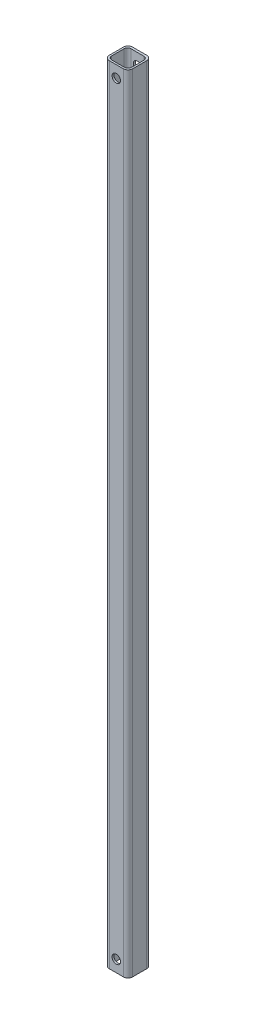
ISO-10303-21;
HEADER;
FILE_DESCRIPTION(('STEP AP214'),'2;1');
FILE_NAME('part.step','',(''),(''),'','','');
FILE_SCHEMA(('AUTOMOTIVE_DESIGN { 1 0 10303 214 1 1 1 1 }'));
ENDSEC;
DATA;
#1=APPLICATION_CONTEXT('core data for automotive mechanical design processes');
#2=APPLICATION_PROTOCOL_DEFINITION('international standard','automotive_design',2000,#1);
#3=PRODUCT_CONTEXT('',#1,'mechanical');
#4=PRODUCT('Part','Part','',(#3));
#5=PRODUCT_RELATED_PRODUCT_CATEGORY('part','',(#4));
#6=PRODUCT_DEFINITION_FORMATION('','',#4);
#7=PRODUCT_DEFINITION_CONTEXT('part definition',#1,'design');
#8=PRODUCT_DEFINITION('design','',#6,#7);
#9=PRODUCT_DEFINITION_SHAPE('','',#8);
#10=(LENGTH_UNIT() NAMED_UNIT(*) SI_UNIT(.MILLI.,.METRE.));
#11=(NAMED_UNIT(*) PLANE_ANGLE_UNIT() SI_UNIT($,.RADIAN.));
#12=(NAMED_UNIT(*) SI_UNIT($,.STERADIAN.) SOLID_ANGLE_UNIT());
#13=UNCERTAINTY_MEASURE_WITH_UNIT(LENGTH_MEASURE(1.E-05),#10,'distance_accuracy_value','');
#14=(GEOMETRIC_REPRESENTATION_CONTEXT(3) GLOBAL_UNCERTAINTY_ASSIGNED_CONTEXT((#13)) GLOBAL_UNIT_ASSIGNED_CONTEXT((#10,
#11,#12)) REPRESENTATION_CONTEXT('',''));
#15=CARTESIAN_POINT('',(0.,0.,0.));
#16=DIRECTION('',(0.,0.,1.));
#17=DIRECTION('',(1.,0.,0.));
#18=AXIS2_PLACEMENT_3D('',#15,#16,#17);
#19=CARTESIAN_POINT('',(9.525,533.4,-15.875));
#20=DIRECTION('',(0.,0.,1.));
#21=DIRECTION('',(1.,0.,0.));
#22=AXIS2_PLACEMENT_3D('',#19,#20,#21);
#23=PLANE('',#22);
#24=DIRECTION('',(-1.,0.,0.));
#25=VECTOR('',#24,1.);
#26=CARTESIAN_POINT('',(9.525,-533.4,-15.875));
#27=LINE('',#26,#25);
#28=CARTESIAN_POINT('',(9.525,-533.4,-15.875));
#29=VERTEX_POINT('',#28);
#30=CARTESIAN_POINT('',(-9.525,-533.4,-15.875));
#31=VERTEX_POINT('',#30);
#32=EDGE_CURVE('E247',#29,#31,#27,.T.);
#33=ORIENTED_EDGE('',*,*,#32,.T.);
#34=DIRECTION('',(0.,-1.,0.));
#35=VECTOR('',#34,1.);
#36=CARTESIAN_POINT('',(-9.525,533.4,-15.875));
#37=LINE('',#36,#35);
#38=CARTESIAN_POINT('',(-9.525,533.4,-15.875));
#39=VERTEX_POINT('',#38);
#40=EDGE_CURVE('E45',#39,#31,#37,.T.);
#41=ORIENTED_EDGE('',*,*,#40,.F.);
#42=DIRECTION('',(-1.,0.,0.));
#43=VECTOR('',#42,1.);
#44=CARTESIAN_POINT('',(9.525,533.4,-15.875));
#45=LINE('',#44,#43);
#46=CARTESIAN_POINT('',(9.525,533.4,-15.875));
#47=VERTEX_POINT('',#46);
#48=EDGE_CURVE('E229',#47,#39,#45,.T.);
#49=ORIENTED_EDGE('',*,*,#48,.F.);
#50=DIRECTION('',(0.,-1.,0.));
#51=VECTOR('',#50,1.);
#52=CARTESIAN_POINT('',(9.525,533.4,-15.875));
#53=LINE('',#52,#51);
#54=EDGE_CURVE('E11',#47,#29,#53,.T.);
#55=ORIENTED_EDGE('',*,*,#54,.T.);
#56=EDGE_LOOP('',(#33,#41,#49,#55));
#57=FACE_BOUND('',#56,.T.);
#58=CARTESIAN_POINT('',(0.,517.525,-15.875));
#59=DIRECTION('',(0.,0.,1.));
#60=DIRECTION('',(1.,0.,0.));
#61=AXIS2_PLACEMENT_3D('',#58,#59,#60);
#62=CIRCLE('',#61,5.71499999999998);
#63=CARTESIAN_POINT('',(5.71499999999998,517.525,-15.875));
#64=VERTEX_POINT('',#63);
#65=EDGE_CURVE('E286',#64,#64,#62,.T.);
#66=ORIENTED_EDGE('',*,*,#65,.T.);
#67=EDGE_LOOP('',(#66));
#68=FACE_BOUND('',#67,.T.);
#69=CARTESIAN_POINT('',(0.,-517.525,-15.875));
#70=DIRECTION('',(0.,0.,-1.));
#71=DIRECTION('',(1.,0.,0.));
#72=AXIS2_PLACEMENT_3D('',#69,#70,#71);
#73=CIRCLE('',#72,5.71499999999998);
#74=CARTESIAN_POINT('',(5.71499999999998,-517.525,-15.875));
#75=VERTEX_POINT('',#74);
#76=EDGE_CURVE('E304',#75,#75,#73,.T.);
#77=ORIENTED_EDGE('',*,*,#76,.F.);
#78=EDGE_LOOP('',(#77));
#79=FACE_BOUND('',#78,.T.);
#80=ADVANCED_FACE('F36',(#57,#68,#79),#23,.F.);
#81=CARTESIAN_POINT('',(-9.525,533.4,15.875));
#82=DIRECTION('',(0.,0.,-1.));
#83=DIRECTION('',(-1.,0.,0.));
#84=AXIS2_PLACEMENT_3D('',#81,#82,#83);
#85=PLANE('',#84);
#86=DIRECTION('',(1.,0.,0.));
#87=VECTOR('',#86,1.);
#88=CARTESIAN_POINT('',(-9.525,-533.4,15.875));
#89=LINE('',#88,#87);
#90=CARTESIAN_POINT('',(-9.525,-533.4,15.875));
#91=VERTEX_POINT('',#90);
#92=CARTESIAN_POINT('',(9.525,-533.4,15.875));
#93=VERTEX_POINT('',#92);
#94=EDGE_CURVE('E255',#91,#93,#89,.T.);
#95=ORIENTED_EDGE('',*,*,#94,.T.);
#96=DIRECTION('',(0.,-1.,0.));
#97=VECTOR('',#96,1.);
#98=CARTESIAN_POINT('',(9.525,533.4,15.875));
#99=LINE('',#98,#97);
#100=CARTESIAN_POINT('',(9.525,533.4,15.875));
#101=VERTEX_POINT('',#100);
#102=EDGE_CURVE('E267',#101,#93,#99,.T.);
#103=ORIENTED_EDGE('',*,*,#102,.F.);
#104=DIRECTION('',(1.,0.,0.));
#105=VECTOR('',#104,1.);
#106=CARTESIAN_POINT('',(-9.525,533.4,15.875));
#107=LINE('',#106,#105);
#108=CARTESIAN_POINT('',(-9.525,533.4,15.875));
#109=VERTEX_POINT('',#108);
#110=EDGE_CURVE('E238',#109,#101,#107,.T.);
#111=ORIENTED_EDGE('',*,*,#110,.F.);
#112=DIRECTION('',(0.,-1.,0.));
#113=VECTOR('',#112,1.);
#114=CARTESIAN_POINT('',(-9.525,533.4,15.875));
#115=LINE('',#114,#113);
#116=EDGE_CURVE('E271',#109,#91,#115,.T.);
#117=ORIENTED_EDGE('',*,*,#116,.T.);
#118=EDGE_LOOP('',(#95,#103,#111,#117));
#119=FACE_BOUND('',#118,.T.);
#120=CARTESIAN_POINT('',(0.,517.525,15.875));
#121=DIRECTION('',(0.,0.,1.));
#122=DIRECTION('',(1.,0.,0.));
#123=AXIS2_PLACEMENT_3D('',#120,#121,#122);
#124=CIRCLE('',#123,5.71499999999998);
#125=CARTESIAN_POINT('',(5.71499999999998,517.525,15.875));
#126=VERTEX_POINT('',#125);
#127=EDGE_CURVE('E291',#126,#126,#124,.T.);
#128=ORIENTED_EDGE('',*,*,#127,.F.);
#129=EDGE_LOOP('',(#128));
#130=FACE_BOUND('',#129,.T.);
#131=CARTESIAN_POINT('',(0.,-517.525,15.875));
#132=DIRECTION('',(0.,0.,-1.));
#133=DIRECTION('',(1.,0.,0.));
#134=AXIS2_PLACEMENT_3D('',#131,#132,#133);
#135=CIRCLE('',#134,5.71499999999998);
#136=CARTESIAN_POINT('',(5.71499999999998,-517.525,15.875));
#137=VERTEX_POINT('',#136);
#138=EDGE_CURVE('E301',#137,#137,#135,.T.);
#139=ORIENTED_EDGE('',*,*,#138,.T.);
#140=EDGE_LOOP('',(#139));
#141=FACE_BOUND('',#140,.T.);
#142=ADVANCED_FACE('F327',(#119,#130,#141),#85,.F.);
#143=CARTESIAN_POINT('',(-8.6995,533.4,13.462));
#144=DIRECTION('',(0.,0.,-1.));
#145=DIRECTION('',(-1.,0.,0.));
#146=AXIS2_PLACEMENT_3D('',#143,#144,#145);
#147=PLANE('',#146);
#148=DIRECTION('',(1.,0.,0.));
#149=VECTOR('',#148,1.);
#150=CARTESIAN_POINT('',(-8.6995,-533.4,13.462));
#151=LINE('',#150,#149);
#152=CARTESIAN_POINT('',(-8.6995,-533.4,13.462));
#153=VERTEX_POINT('',#152);
#154=CARTESIAN_POINT('',(8.69949999999999,-533.4,13.462));
#155=VERTEX_POINT('',#154);
#156=EDGE_CURVE('E195',#153,#155,#151,.T.);
#157=ORIENTED_EDGE('',*,*,#156,.F.);
#158=DIRECTION('',(0.,-1.,0.));
#159=VECTOR('',#158,1.);
#160=CARTESIAN_POINT('',(-8.6995,533.4,13.462));
#161=LINE('',#160,#159);
#162=CARTESIAN_POINT('',(-8.6995,533.4,13.462));
#163=VERTEX_POINT('',#162);
#164=EDGE_CURVE('E221',#163,#153,#161,.T.);
#165=ORIENTED_EDGE('',*,*,#164,.F.);
#166=DIRECTION('',(1.,0.,0.));
#167=VECTOR('',#166,1.);
#168=CARTESIAN_POINT('',(-8.6995,533.4,13.462));
#169=LINE('',#168,#167);
#170=CARTESIAN_POINT('',(8.69949999999999,533.4,13.462));
#171=VERTEX_POINT('',#170);
#172=EDGE_CURVE('E176',#163,#171,#169,.T.);
#173=ORIENTED_EDGE('',*,*,#172,.T.);
#174=DIRECTION('',(0.,-1.,0.));
#175=VECTOR('',#174,1.);
#176=CARTESIAN_POINT('',(8.69949999999999,533.4,13.462));
#177=LINE('',#176,#175);
#178=EDGE_CURVE('E218',#171,#155,#177,.T.);
#179=ORIENTED_EDGE('',*,*,#178,.T.);
#180=EDGE_LOOP('',(#157,#165,#173,#179));
#181=FACE_BOUND('',#180,.T.);
#182=CARTESIAN_POINT('',(0.,517.525,13.462));
#183=DIRECTION('',(0.,0.,-1.));
#184=DIRECTION('',(-1.,0.,0.));
#185=AXIS2_PLACEMENT_3D('',#182,#183,#184);
#186=CIRCLE('',#185,5.71499999999998);
#187=CARTESIAN_POINT('',(-5.71499999999999,517.525,13.462));
#188=VERTEX_POINT('',#187);
#189=EDGE_CURVE('E190',#188,#188,#186,.T.);
#190=ORIENTED_EDGE('',*,*,#189,.F.);
#191=EDGE_LOOP('',(#190));
#192=FACE_BOUND('',#191,.T.);
#193=CARTESIAN_POINT('',(0.,-517.525,13.462));
#194=DIRECTION('',(0.,0.,-1.));
#195=DIRECTION('',(-1.,0.,0.));
#196=AXIS2_PLACEMENT_3D('',#193,#194,#195);
#197=CIRCLE('',#196,5.71499999999998);
#198=CARTESIAN_POINT('',(-5.71499999999999,-517.525,13.462));
#199=VERTEX_POINT('',#198);
#200=EDGE_CURVE('E296',#199,#199,#197,.F.);
#201=ORIENTED_EDGE('',*,*,#200,.T.);
#202=EDGE_LOOP('',(#201));
#203=FACE_BOUND('',#202,.T.);
#204=ADVANCED_FACE('F332',(#181,#192,#203),#147,.T.);
#205=CARTESIAN_POINT('',(8.6995,533.4,-12.827));
#206=DIRECTION('',(0.,0.,1.));
#207=DIRECTION('',(1.,0.,0.));
#208=AXIS2_PLACEMENT_3D('',#205,#206,#207);
#209=PLANE('',#208);
#210=DIRECTION('',(-1.,0.,0.));
#211=VECTOR('',#210,1.);
#212=CARTESIAN_POINT('',(8.6995,-533.4,-12.827));
#213=LINE('',#212,#211);
#214=CARTESIAN_POINT('',(8.6995,-533.4,-12.827));
#215=VERTEX_POINT('',#214);
#216=CARTESIAN_POINT('',(-8.69950000000001,-533.4,-12.827));
#217=VERTEX_POINT('',#216);
#218=EDGE_CURVE('E160',#215,#217,#213,.T.);
#219=ORIENTED_EDGE('',*,*,#218,.F.);
#220=DIRECTION('',(0.,-1.,0.));
#221=VECTOR('',#220,1.);
#222=CARTESIAN_POINT('',(8.6995,533.4,-12.827));
#223=LINE('',#222,#221);
#224=CARTESIAN_POINT('',(8.6995,533.4,-12.827));
#225=VERTEX_POINT('',#224);
#226=EDGE_CURVE('E53',#225,#215,#223,.T.);
#227=ORIENTED_EDGE('',*,*,#226,.F.);
#228=DIRECTION('',(-1.,0.,0.));
#229=VECTOR('',#228,1.);
#230=CARTESIAN_POINT('',(8.6995,533.4,-12.827));
#231=LINE('',#230,#229);
#232=CARTESIAN_POINT('',(-8.69950000000001,533.4,-12.827));
#233=VERTEX_POINT('',#232);
#234=EDGE_CURVE('E187',#225,#233,#231,.T.);
#235=ORIENTED_EDGE('',*,*,#234,.T.);
#236=DIRECTION('',(0.,-1.,0.));
#237=VECTOR('',#236,1.);
#238=CARTESIAN_POINT('',(-8.69950000000001,533.4,-12.827));
#239=LINE('',#238,#237);
#240=EDGE_CURVE('E155',#233,#217,#239,.T.);
#241=ORIENTED_EDGE('',*,*,#240,.T.);
#242=EDGE_LOOP('',(#219,#227,#235,#241));
#243=FACE_BOUND('',#242,.T.);
#244=CARTESIAN_POINT('',(0.,517.525,-12.827));
#245=DIRECTION('',(0.,0.,1.));
#246=DIRECTION('',(1.,0.,0.));
#247=AXIS2_PLACEMENT_3D('',#244,#245,#246);
#248=CIRCLE('',#247,5.71499999999998);
#249=CARTESIAN_POINT('',(5.71499999999998,517.525,-12.827));
#250=VERTEX_POINT('',#249);
#251=EDGE_CURVE('E284',#250,#250,#248,.T.);
#252=ORIENTED_EDGE('',*,*,#251,.F.);
#253=EDGE_LOOP('',(#252));
#254=FACE_BOUND('',#253,.T.);
#255=CARTESIAN_POINT('',(0.,-517.525,-12.827));
#256=DIRECTION('',(0.,0.,1.));
#257=DIRECTION('',(1.,0.,0.));
#258=AXIS2_PLACEMENT_3D('',#255,#256,#257);
#259=CIRCLE('',#258,5.71499999999998);
#260=CARTESIAN_POINT('',(5.71499999999998,-517.525,-12.827));
#261=VERTEX_POINT('',#260);
#262=EDGE_CURVE('E40',#261,#261,#259,.F.);
#263=ORIENTED_EDGE('',*,*,#262,.T.);
#264=EDGE_LOOP('',(#263));
#265=FACE_BOUND('',#264,.T.);
#266=ADVANCED_FACE('F311',(#243,#254,#265),#209,.T.);
#267=CARTESIAN_POINT('',(9.525,533.4,-9.52499999999998));
#268=DIRECTION('',(0.,1.,0.));
#269=DIRECTION('',(0.,0.,1.));
#270=AXIS2_PLACEMENT_3D('',#267,#268,#269);
#271=PLANE('',#270);
#272=CARTESIAN_POINT('',(9.525,533.4,-9.52499999999998));
#273=DIRECTION('',(0.,1.,0.));
#274=DIRECTION('',(0.,0.,1.));
#275=AXIS2_PLACEMENT_3D('',#272,#273,#274);
#276=CIRCLE('',#275,6.35);
#277=CARTESIAN_POINT('',(15.875,533.4,-9.52499999999998));
#278=VERTEX_POINT('',#277);
#279=EDGE_CURVE('E226',#278,#47,#276,.T.);
#280=ORIENTED_EDGE('',*,*,#279,.T.);
#281=ORIENTED_EDGE('',*,*,#48,.T.);
#282=CARTESIAN_POINT('',(-9.525,533.4,-9.52499999999998));
#283=DIRECTION('',(0.,1.,0.));
#284=DIRECTION('',(0.,0.,1.));
#285=AXIS2_PLACEMENT_3D('',#282,#283,#284);
#286=CIRCLE('',#285,6.35);
#287=CARTESIAN_POINT('',(-15.875,533.4,-9.52499999999998));
#288=VERTEX_POINT('',#287);
#289=EDGE_CURVE('E232',#39,#288,#286,.T.);
#290=ORIENTED_EDGE('',*,*,#289,.T.);
#291=DIRECTION('',(0.,0.,1.));
#292=VECTOR('',#291,1.);
#293=CARTESIAN_POINT('',(-15.875,533.4,9.52500000000002));
#294=LINE('',#293,#292);
#295=CARTESIAN_POINT('',(-15.875,533.4,9.52500000000002));
#296=VERTEX_POINT('',#295);
#297=EDGE_CURVE('E234',#288,#296,#294,.T.);
#298=ORIENTED_EDGE('',*,*,#297,.T.);
#299=CARTESIAN_POINT('',(-9.525,533.4,9.52500000000002));
#300=DIRECTION('',(0.,1.,0.));
#301=DIRECTION('',(0.,0.,1.));
#302=AXIS2_PLACEMENT_3D('',#299,#300,#301);
#303=CIRCLE('',#302,6.35);
#304=EDGE_CURVE('E236',#296,#109,#303,.T.);
#305=ORIENTED_EDGE('',*,*,#304,.T.);
#306=ORIENTED_EDGE('',*,*,#110,.T.);
#307=CARTESIAN_POINT('',(9.525,533.4,9.52500000000002));
#308=DIRECTION('',(0.,1.,0.));
#309=DIRECTION('',(0.,0.,1.));
#310=AXIS2_PLACEMENT_3D('',#307,#308,#309);
#311=CIRCLE('',#310,6.35);
#312=CARTESIAN_POINT('',(15.875,533.4,9.52500000000002));
#313=VERTEX_POINT('',#312);
#314=EDGE_CURVE('E240',#101,#313,#311,.T.);
#315=ORIENTED_EDGE('',*,*,#314,.T.);
#316=DIRECTION('',(0.,0.,-1.));
#317=VECTOR('',#316,1.);
#318=CARTESIAN_POINT('',(15.875,533.4,-9.52499999999998));
#319=LINE('',#318,#317);
#320=EDGE_CURVE('E242',#313,#278,#319,.T.);
#321=ORIENTED_EDGE('',*,*,#320,.T.);
#322=EDGE_LOOP('',(#280,#281,#290,#298,#305,#306,#315,#321));
#323=FACE_BOUND('',#322,.T.);
#324=DIRECTION('',(0.,0.,1.));
#325=VECTOR('',#324,1.);
#326=CARTESIAN_POINT('',(-13.462,533.4,8.69950000000002));
#327=LINE('',#326,#325);
#328=CARTESIAN_POINT('',(-13.462,533.4,-8.06449999999998));
#329=VERTEX_POINT('',#328);
#330=CARTESIAN_POINT('',(-13.462,533.4,8.69950000000002));
#331=VERTEX_POINT('',#330);
#332=EDGE_CURVE('E159',#329,#331,#327,.T.);
#333=ORIENTED_EDGE('',*,*,#332,.F.);
#334=CARTESIAN_POINT('',(-8.69950000000001,533.4,-8.06449999999998));
#335=DIRECTION('',(0.,1.,0.));
#336=DIRECTION('',(0.,0.,1.));
#337=AXIS2_PLACEMENT_3D('',#334,#335,#336);
#338=CIRCLE('',#337,4.7625);
#339=EDGE_CURVE('E151',#233,#329,#338,.T.);
#340=ORIENTED_EDGE('',*,*,#339,.F.);
#341=ORIENTED_EDGE('',*,*,#234,.F.);
#342=CARTESIAN_POINT('',(8.6995,533.4,-8.06449999999998));
#343=DIRECTION('',(0.,1.,0.));
#344=DIRECTION('',(0.,0.,1.));
#345=AXIS2_PLACEMENT_3D('',#342,#343,#344);
#346=CIRCLE('',#345,4.7625);
#347=CARTESIAN_POINT('',(13.462,533.4,-8.06449999999998));
#348=VERTEX_POINT('',#347);
#349=EDGE_CURVE('E185',#348,#225,#346,.T.);
#350=ORIENTED_EDGE('',*,*,#349,.F.);
#351=DIRECTION('',(0.,0.,-1.));
#352=VECTOR('',#351,1.);
#353=CARTESIAN_POINT('',(13.462,533.4,-8.06449999999998));
#354=LINE('',#353,#352);
#355=CARTESIAN_POINT('',(13.462,533.4,8.69950000000002));
#356=VERTEX_POINT('',#355);
#357=EDGE_CURVE('E183',#356,#348,#354,.T.);
#358=ORIENTED_EDGE('',*,*,#357,.F.);
#359=CARTESIAN_POINT('',(8.6995,533.4,8.69950000000002));
#360=DIRECTION('',(0.,1.,0.));
#361=DIRECTION('',(0.,0.,1.));
#362=AXIS2_PLACEMENT_3D('',#359,#360,#361);
#363=CIRCLE('',#362,4.7625);
#364=EDGE_CURVE('E181',#171,#356,#363,.T.);
#365=ORIENTED_EDGE('',*,*,#364,.F.);
#366=ORIENTED_EDGE('',*,*,#172,.F.);
#367=CARTESIAN_POINT('',(-8.6995,533.4,8.69950000000002));
#368=DIRECTION('',(0.,1.,0.));
#369=DIRECTION('',(0.,0.,1.));
#370=AXIS2_PLACEMENT_3D('',#367,#368,#369);
#371=CIRCLE('',#370,4.7625);
#372=EDGE_CURVE('E174',#331,#163,#371,.T.);
#373=ORIENTED_EDGE('',*,*,#372,.F.);
#374=EDGE_LOOP('',(#333,#340,#341,#350,#358,#365,#366,#373));
#375=FACE_BOUND('',#374,.T.);
#376=ADVANCED_FACE('F172',(#323,#375),#271,.T.);
#377=CARTESIAN_POINT('',(9.525,-533.4,-9.52499999999998));
#378=DIRECTION('',(0.,1.,0.));
#379=DIRECTION('',(0.,0.,1.));
#380=AXIS2_PLACEMENT_3D('',#377,#378,#379);
#381=PLANE('',#380);
#382=CARTESIAN_POINT('',(9.525,-533.4,-9.52499999999998));
#383=DIRECTION('',(0.,1.,0.));
#384=DIRECTION('',(0.,0.,1.));
#385=AXIS2_PLACEMENT_3D('',#382,#383,#384);
#386=CIRCLE('',#385,6.35);
#387=CARTESIAN_POINT('',(15.875,-533.4,-9.52499999999998));
#388=VERTEX_POINT('',#387);
#389=EDGE_CURVE('E168',#388,#29,#386,.T.);
#390=ORIENTED_EDGE('',*,*,#389,.F.);
#391=DIRECTION('',(0.,0.,-1.));
#392=VECTOR('',#391,1.);
#393=CARTESIAN_POINT('',(15.875,-533.4,-9.52499999999998));
#394=LINE('',#393,#392);
#395=CARTESIAN_POINT('',(15.875,-533.4,9.52500000000002));
#396=VERTEX_POINT('',#395);
#397=EDGE_CURVE('E230',#396,#388,#394,.T.);
#398=ORIENTED_EDGE('',*,*,#397,.F.);
#399=CARTESIAN_POINT('',(9.525,-533.4,9.52500000000002));
#400=DIRECTION('',(0.,1.,0.));
#401=DIRECTION('',(0.,0.,1.));
#402=AXIS2_PLACEMENT_3D('',#399,#400,#401);
#403=CIRCLE('',#402,6.35);
#404=EDGE_CURVE('E257',#93,#396,#403,.T.);
#405=ORIENTED_EDGE('',*,*,#404,.F.);
#406=ORIENTED_EDGE('',*,*,#94,.F.);
#407=CARTESIAN_POINT('',(-9.525,-533.4,9.52500000000002));
#408=DIRECTION('',(0.,1.,0.));
#409=DIRECTION('',(0.,0.,1.));
#410=AXIS2_PLACEMENT_3D('',#407,#408,#409);
#411=CIRCLE('',#410,6.35);
#412=CARTESIAN_POINT('',(-15.875,-533.4,9.52500000000002));
#413=VERTEX_POINT('',#412);
#414=EDGE_CURVE('E253',#413,#91,#411,.T.);
#415=ORIENTED_EDGE('',*,*,#414,.F.);
#416=DIRECTION('',(0.,0.,1.));
#417=VECTOR('',#416,1.);
#418=CARTESIAN_POINT('',(-15.875,-533.4,9.52500000000002));
#419=LINE('',#418,#417);
#420=CARTESIAN_POINT('',(-15.875,-533.4,-9.52499999999998));
#421=VERTEX_POINT('',#420);
#422=EDGE_CURVE('E251',#421,#413,#419,.T.);
#423=ORIENTED_EDGE('',*,*,#422,.F.);
#424=CARTESIAN_POINT('',(-9.525,-533.4,-9.52499999999998));
#425=DIRECTION('',(0.,1.,0.));
#426=DIRECTION('',(0.,0.,1.));
#427=AXIS2_PLACEMENT_3D('',#424,#425,#426);
#428=CIRCLE('',#427,6.35);
#429=EDGE_CURVE('E249',#31,#421,#428,.T.);
#430=ORIENTED_EDGE('',*,*,#429,.F.);
#431=ORIENTED_EDGE('',*,*,#32,.F.);
#432=EDGE_LOOP('',(#390,#398,#405,#406,#415,#423,#430,#431));
#433=FACE_BOUND('',#432,.T.);
#434=CARTESIAN_POINT('',(-8.69950000000001,-533.4,-8.06449999999998));
#435=DIRECTION('',(0.,1.,0.));
#436=DIRECTION('',(0.,0.,1.));
#437=AXIS2_PLACEMENT_3D('',#434,#435,#436);
#438=CIRCLE('',#437,4.7625);
#439=CARTESIAN_POINT('',(-13.462,-533.4,-8.06449999999998));
#440=VERTEX_POINT('',#439);
#441=EDGE_CURVE('E61',#217,#440,#438,.T.);
#442=ORIENTED_EDGE('',*,*,#441,.T.);
#443=DIRECTION('',(0.,0.,1.));
#444=VECTOR('',#443,1.);
#445=CARTESIAN_POINT('',(-13.462,-533.4,8.69950000000002));
#446=LINE('',#445,#444);
#447=CARTESIAN_POINT('',(-13.462,-533.4,8.69950000000002));
#448=VERTEX_POINT('',#447);
#449=EDGE_CURVE('E166',#440,#448,#446,.T.);
#450=ORIENTED_EDGE('',*,*,#449,.T.);
#451=CARTESIAN_POINT('',(-8.6995,-533.4,8.69950000000002));
#452=DIRECTION('',(0.,1.,0.));
#453=DIRECTION('',(0.,0.,1.));
#454=AXIS2_PLACEMENT_3D('',#451,#452,#453);
#455=CIRCLE('',#454,4.7625);
#456=EDGE_CURVE('E192',#448,#153,#455,.T.);
#457=ORIENTED_EDGE('',*,*,#456,.T.);
#458=ORIENTED_EDGE('',*,*,#156,.T.);
#459=CARTESIAN_POINT('',(8.6995,-533.4,8.69950000000002));
#460=DIRECTION('',(0.,1.,0.));
#461=DIRECTION('',(0.,0.,1.));
#462=AXIS2_PLACEMENT_3D('',#459,#460,#461);
#463=CIRCLE('',#462,4.7625);
#464=CARTESIAN_POINT('',(13.462,-533.4,8.69950000000002));
#465=VERTEX_POINT('',#464);
#466=EDGE_CURVE('E198',#155,#465,#463,.T.);
#467=ORIENTED_EDGE('',*,*,#466,.T.);
#468=DIRECTION('',(0.,0.,-1.));
#469=VECTOR('',#468,1.);
#470=CARTESIAN_POINT('',(13.462,-533.4,-8.06449999999998));
#471=LINE('',#470,#469);
#472=CARTESIAN_POINT('',(13.462,-533.4,-8.06449999999998));
#473=VERTEX_POINT('',#472);
#474=EDGE_CURVE('E201',#465,#473,#471,.T.);
#475=ORIENTED_EDGE('',*,*,#474,.T.);
#476=CARTESIAN_POINT('',(8.6995,-533.4,-8.06449999999998));
#477=DIRECTION('',(0.,1.,0.));
#478=DIRECTION('',(0.,0.,1.));
#479=AXIS2_PLACEMENT_3D('',#476,#477,#478);
#480=CIRCLE('',#479,4.7625);
#481=EDGE_CURVE('E204',#473,#215,#480,.T.);
#482=ORIENTED_EDGE('',*,*,#481,.T.);
#483=ORIENTED_EDGE('',*,*,#218,.T.);
#484=EDGE_LOOP('',(#442,#450,#457,#458,#467,#475,#482,#483));
#485=FACE_BOUND('',#484,.T.);
#486=ADVANCED_FACE('F356',(#433,#485),#381,.F.);
#487=CARTESIAN_POINT('',(9.525,533.4,-9.52499999999998));
#488=DIRECTION('',(0.,-1.,0.));
#489=DIRECTION('',(0.,0.,-1.));
#490=AXIS2_PLACEMENT_3D('',#487,#488,#489);
#491=CYLINDRICAL_SURFACE('',#490,6.35);
#492=ORIENTED_EDGE('',*,*,#389,.T.);
#493=ORIENTED_EDGE('',*,*,#54,.F.);
#494=ORIENTED_EDGE('',*,*,#279,.F.);
#495=DIRECTION('',(0.,-1.,0.));
#496=VECTOR('',#495,1.);
#497=CARTESIAN_POINT('',(15.875,533.4,-9.52499999999998));
#498=LINE('',#497,#496);
#499=EDGE_CURVE('E244',#278,#388,#498,.T.);
#500=ORIENTED_EDGE('',*,*,#499,.T.);
#501=EDGE_LOOP('',(#492,#493,#494,#500));
#502=FACE_BOUND('',#501,.T.);
#503=ADVANCED_FACE('F38',(#502),#491,.T.);
#504=CARTESIAN_POINT('',(-9.525,533.4,-9.52499999999998));
#505=DIRECTION('',(0.,-1.,0.));
#506=DIRECTION('',(0.,0.,-1.));
#507=AXIS2_PLACEMENT_3D('',#504,#505,#506);
#508=CYLINDRICAL_SURFACE('',#507,6.35);
#509=ORIENTED_EDGE('',*,*,#429,.T.);
#510=DIRECTION('',(0.,-1.,0.));
#511=VECTOR('',#510,1.);
#512=CARTESIAN_POINT('',(-15.875,533.4,-9.52499999999998));
#513=LINE('',#512,#511);
#514=EDGE_CURVE('E279',#288,#421,#513,.T.);
#515=ORIENTED_EDGE('',*,*,#514,.F.);
#516=ORIENTED_EDGE('',*,*,#289,.F.);
#517=ORIENTED_EDGE('',*,*,#40,.T.);
#518=EDGE_LOOP('',(#509,#515,#516,#517));
#519=FACE_BOUND('',#518,.T.);
#520=ADVANCED_FACE('F336',(#519),#508,.T.);
#521=CARTESIAN_POINT('',(-15.875,533.4,9.52500000000002));
#522=DIRECTION('',(1.,0.,0.));
#523=DIRECTION('',(0.,0.,-1.));
#524=AXIS2_PLACEMENT_3D('',#521,#522,#523);
#525=PLANE('',#524);
#526=ORIENTED_EDGE('',*,*,#422,.T.);
#527=DIRECTION('',(0.,-1.,0.));
#528=VECTOR('',#527,1.);
#529=CARTESIAN_POINT('',(-15.875,533.4,9.52500000000002));
#530=LINE('',#529,#528);
#531=EDGE_CURVE('E275',#296,#413,#530,.T.);
#532=ORIENTED_EDGE('',*,*,#531,.F.);
#533=ORIENTED_EDGE('',*,*,#297,.F.);
#534=ORIENTED_EDGE('',*,*,#514,.T.);
#535=EDGE_LOOP('',(#526,#532,#533,#534));
#536=FACE_BOUND('',#535,.T.);
#537=ADVANCED_FACE('F339',(#536),#525,.F.);
#538=CARTESIAN_POINT('',(-9.525,533.4,9.52500000000002));
#539=DIRECTION('',(0.,-1.,0.));
#540=DIRECTION('',(0.,0.,-1.));
#541=AXIS2_PLACEMENT_3D('',#538,#539,#540);
#542=CYLINDRICAL_SURFACE('',#541,6.35);
#543=ORIENTED_EDGE('',*,*,#414,.T.);
#544=ORIENTED_EDGE('',*,*,#116,.F.);
#545=ORIENTED_EDGE('',*,*,#304,.F.);
#546=ORIENTED_EDGE('',*,*,#531,.T.);
#547=EDGE_LOOP('',(#543,#544,#545,#546));
#548=FACE_BOUND('',#547,.T.);
#549=ADVANCED_FACE('F343',(#548),#542,.T.);
#550=CARTESIAN_POINT('',(9.525,533.4,9.52500000000002));
#551=DIRECTION('',(0.,-1.,0.));
#552=DIRECTION('',(0.,0.,-1.));
#553=AXIS2_PLACEMENT_3D('',#550,#551,#552);
#554=CYLINDRICAL_SURFACE('',#553,6.35);
#555=ORIENTED_EDGE('',*,*,#404,.T.);
#556=DIRECTION('',(0.,-1.,0.));
#557=VECTOR('',#556,1.);
#558=CARTESIAN_POINT('',(15.875,533.4,9.52500000000002));
#559=LINE('',#558,#557);
#560=EDGE_CURVE('E263',#313,#396,#559,.T.);
#561=ORIENTED_EDGE('',*,*,#560,.F.);
#562=ORIENTED_EDGE('',*,*,#314,.F.);
#563=ORIENTED_EDGE('',*,*,#102,.T.);
#564=EDGE_LOOP('',(#555,#561,#562,#563));
#565=FACE_BOUND('',#564,.T.);
#566=ADVANCED_FACE('F346',(#565),#554,.T.);
#567=CARTESIAN_POINT('',(15.875,533.4,-9.52499999999998));
#568=DIRECTION('',(-1.,0.,0.));
#569=DIRECTION('',(0.,0.,1.));
#570=AXIS2_PLACEMENT_3D('',#567,#568,#569);
#571=PLANE('',#570);
#572=ORIENTED_EDGE('',*,*,#397,.T.);
#573=ORIENTED_EDGE('',*,*,#499,.F.);
#574=ORIENTED_EDGE('',*,*,#320,.F.);
#575=ORIENTED_EDGE('',*,*,#560,.T.);
#576=EDGE_LOOP('',(#572,#573,#574,#575));
#577=FACE_BOUND('',#576,.T.);
#578=ADVANCED_FACE('F351',(#577),#571,.F.);
#579=CARTESIAN_POINT('',(-8.69950000000001,533.4,-8.06449999999998));
#580=DIRECTION('',(0.,-1.,0.));
#581=DIRECTION('',(0.,0.,-1.));
#582=AXIS2_PLACEMENT_3D('',#579,#580,#581);
#583=CYLINDRICAL_SURFACE('',#582,4.7625);
#584=ORIENTED_EDGE('',*,*,#441,.F.);
#585=ORIENTED_EDGE('',*,*,#240,.F.);
#586=ORIENTED_EDGE('',*,*,#339,.T.);
#587=DIRECTION('',(0.,-1.,0.));
#588=VECTOR('',#587,1.);
#589=CARTESIAN_POINT('',(-13.462,533.4,-8.06449999999998));
#590=LINE('',#589,#588);
#591=EDGE_CURVE('E154',#329,#440,#590,.T.);
#592=ORIENTED_EDGE('',*,*,#591,.T.);
#593=EDGE_LOOP('',(#584,#585,#586,#592));
#594=FACE_BOUND('',#593,.T.);
#595=ADVANCED_FACE('F153',(#594),#583,.F.);
#596=CARTESIAN_POINT('',(-13.462,533.4,8.69950000000002));
#597=DIRECTION('',(1.,0.,0.));
#598=DIRECTION('',(0.,0.,-1.));
#599=AXIS2_PLACEMENT_3D('',#596,#597,#598);
#600=PLANE('',#599);
#601=ORIENTED_EDGE('',*,*,#449,.F.);
#602=ORIENTED_EDGE('',*,*,#591,.F.);
#603=ORIENTED_EDGE('',*,*,#332,.T.);
#604=DIRECTION('',(0.,-1.,0.));
#605=VECTOR('',#604,1.);
#606=CARTESIAN_POINT('',(-13.462,533.4,8.69950000000002));
#607=LINE('',#606,#605);
#608=EDGE_CURVE('E169',#331,#448,#607,.T.);
#609=ORIENTED_EDGE('',*,*,#608,.T.);
#610=EDGE_LOOP('',(#601,#602,#603,#609));
#611=FACE_BOUND('',#610,.T.);
#612=ADVANCED_FACE('F163',(#611),#600,.T.);
#613=CARTESIAN_POINT('',(-8.6995,533.4,8.69950000000002));
#614=DIRECTION('',(0.,-1.,0.));
#615=DIRECTION('',(0.,0.,-1.));
#616=AXIS2_PLACEMENT_3D('',#613,#614,#615);
#617=CYLINDRICAL_SURFACE('',#616,4.7625);
#618=ORIENTED_EDGE('',*,*,#456,.F.);
#619=ORIENTED_EDGE('',*,*,#608,.F.);
#620=ORIENTED_EDGE('',*,*,#372,.T.);
#621=ORIENTED_EDGE('',*,*,#164,.T.);
#622=EDGE_LOOP('',(#618,#619,#620,#621));
#623=FACE_BOUND('',#622,.T.);
#624=ADVANCED_FACE('F367',(#623),#617,.F.);
#625=CARTESIAN_POINT('',(8.6995,533.4,8.69950000000002));
#626=DIRECTION('',(0.,-1.,0.));
#627=DIRECTION('',(0.,0.,-1.));
#628=AXIS2_PLACEMENT_3D('',#625,#626,#627);
#629=CYLINDRICAL_SURFACE('',#628,4.7625);
#630=ORIENTED_EDGE('',*,*,#466,.F.);
#631=ORIENTED_EDGE('',*,*,#178,.F.);
#632=ORIENTED_EDGE('',*,*,#364,.T.);
#633=DIRECTION('',(0.,-1.,0.));
#634=VECTOR('',#633,1.);
#635=CARTESIAN_POINT('',(13.462,533.4,8.69950000000002));
#636=LINE('',#635,#634);
#637=EDGE_CURVE('E215',#356,#465,#636,.T.);
#638=ORIENTED_EDGE('',*,*,#637,.T.);
#639=EDGE_LOOP('',(#630,#631,#632,#638));
#640=FACE_BOUND('',#639,.T.);
#641=ADVANCED_FACE('F370',(#640),#629,.F.);
#642=CARTESIAN_POINT('',(13.462,533.4,-8.06449999999998));
#643=DIRECTION('',(-1.,0.,0.));
#644=DIRECTION('',(0.,0.,1.));
#645=AXIS2_PLACEMENT_3D('',#642,#643,#644);
#646=PLANE('',#645);
#647=ORIENTED_EDGE('',*,*,#474,.F.);
#648=ORIENTED_EDGE('',*,*,#637,.F.);
#649=ORIENTED_EDGE('',*,*,#357,.T.);
#650=DIRECTION('',(0.,-1.,0.));
#651=VECTOR('',#650,1.);
#652=CARTESIAN_POINT('',(13.462,533.4,-8.06449999999998));
#653=LINE('',#652,#651);
#654=EDGE_CURVE('E212',#348,#473,#653,.T.);
#655=ORIENTED_EDGE('',*,*,#654,.T.);
#656=EDGE_LOOP('',(#647,#648,#649,#655));
#657=FACE_BOUND('',#656,.T.);
#658=ADVANCED_FACE('F377',(#657),#646,.T.);
#659=CARTESIAN_POINT('',(8.6995,533.4,-8.06449999999998));
#660=DIRECTION('',(0.,-1.,0.));
#661=DIRECTION('',(0.,0.,-1.));
#662=AXIS2_PLACEMENT_3D('',#659,#660,#661);
#663=CYLINDRICAL_SURFACE('',#662,4.7625);
#664=ORIENTED_EDGE('',*,*,#481,.F.);
#665=ORIENTED_EDGE('',*,*,#654,.F.);
#666=ORIENTED_EDGE('',*,*,#349,.T.);
#667=ORIENTED_EDGE('',*,*,#226,.T.);
#668=EDGE_LOOP('',(#664,#665,#666,#667));
#669=FACE_BOUND('',#668,.T.);
#670=ADVANCED_FACE('F381',(#669),#663,.F.);
#671=CARTESIAN_POINT('',(0.,517.525,-15.875));
#672=DIRECTION('',(0.,0.,1.));
#673=DIRECTION('',(1.,0.,0.));
#674=AXIS2_PLACEMENT_3D('',#671,#672,#673);
#675=CYLINDRICAL_SURFACE('',#674,5.71499999999998);
#676=ORIENTED_EDGE('',*,*,#251,.T.);
#677=EDGE_LOOP('',(#676));
#678=FACE_BOUND('',#677,.T.);
#679=ORIENTED_EDGE('',*,*,#65,.F.);
#680=EDGE_LOOP('',(#679));
#681=FACE_BOUND('',#680,.T.);
#682=ADVANCED_FACE('F323',(#678,#681),#675,.F.);
#683=ORIENTED_EDGE('',*,*,#189,.T.);
#684=EDGE_LOOP('',(#683));
#685=FACE_BOUND('',#684,.T.);
#686=ORIENTED_EDGE('',*,*,#127,.T.);
#687=EDGE_LOOP('',(#686));
#688=FACE_BOUND('',#687,.T.);
#689=ADVANCED_FACE('F316',(#685,#688),#675,.F.);
#690=CARTESIAN_POINT('',(0.,-517.525,-15.875));
#691=DIRECTION('',(0.,0.,1.));
#692=DIRECTION('',(1.,0.,0.));
#693=AXIS2_PLACEMENT_3D('',#690,#691,#692);
#694=CYLINDRICAL_SURFACE('',#693,5.71499999999998);
#695=ORIENTED_EDGE('',*,*,#262,.F.);
#696=EDGE_LOOP('',(#695));
#697=FACE_BOUND('',#696,.T.);
#698=ORIENTED_EDGE('',*,*,#76,.T.);
#699=EDGE_LOOP('',(#698));
#700=FACE_BOUND('',#699,.T.);
#701=ADVANCED_FACE('F313',(#697,#700),#694,.F.);
#702=ORIENTED_EDGE('',*,*,#200,.F.);
#703=EDGE_LOOP('',(#702));
#704=FACE_BOUND('',#703,.T.);
#705=ORIENTED_EDGE('',*,*,#138,.F.);
#706=EDGE_LOOP('',(#705));
#707=FACE_BOUND('',#706,.T.);
#708=ADVANCED_FACE('F315',(#704,#707),#694,.F.);
#709=CLOSED_SHELL('',(#80,#142,#204,#266,#376,#486,#503,#520,#537,#549,#566,#578,#595,#612,#624,
#641,#658,#670,#682,#689,#701,#708));
#710=MANIFOLD_SOLID_BREP('B2',#709);
#711=ADVANCED_BREP_SHAPE_REPRESENTATION('',(#18,#710),#14);
#712=SHAPE_DEFINITION_REPRESENTATION(#9,#711);
ENDSEC;
END-ISO-10303-21;
